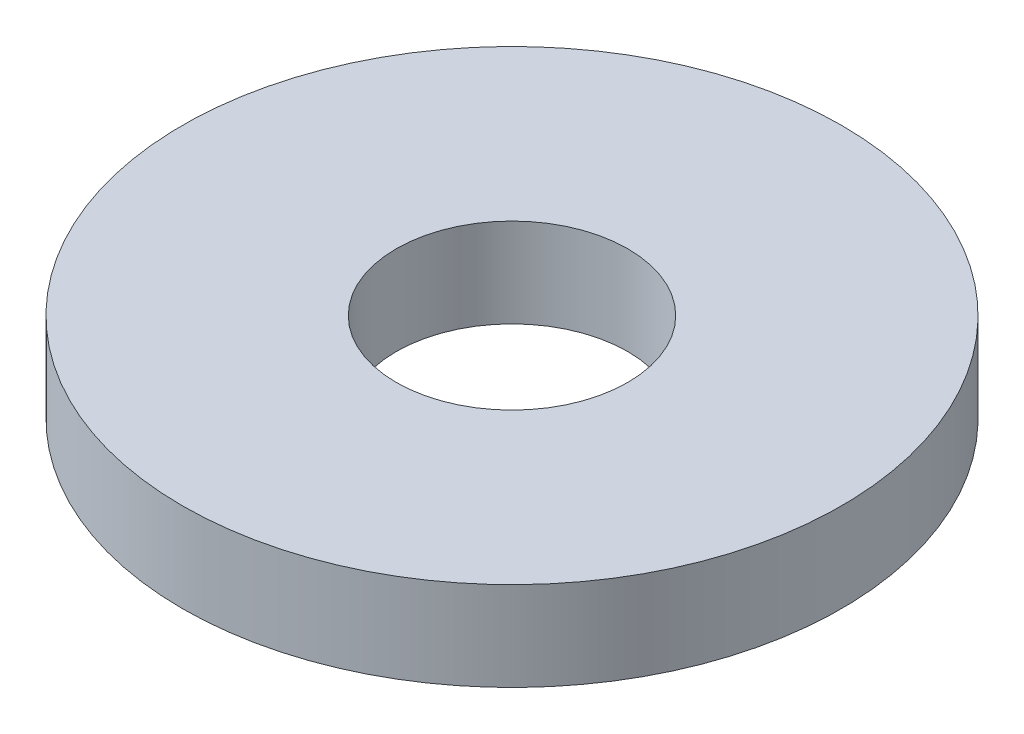
ISO-10303-21;
HEADER;
FILE_DESCRIPTION(('STEP AP214'),'2;1');
FILE_NAME('part.step','',(''),(''),'','','');
FILE_SCHEMA(('AUTOMOTIVE_DESIGN { 1 0 10303 214 1 1 1 1 }'));
ENDSEC;
DATA;
#1=APPLICATION_CONTEXT('core data for automotive mechanical design processes');
#2=APPLICATION_PROTOCOL_DEFINITION('international standard','automotive_design',2000,#1);
#3=PRODUCT_CONTEXT('',#1,'mechanical');
#4=PRODUCT('Part','Part','',(#3));
#5=PRODUCT_RELATED_PRODUCT_CATEGORY('part','',(#4));
#6=PRODUCT_DEFINITION_FORMATION('','',#4);
#7=PRODUCT_DEFINITION_CONTEXT('part definition',#1,'design');
#8=PRODUCT_DEFINITION('design','',#6,#7);
#9=PRODUCT_DEFINITION_SHAPE('','',#8);
#10=(LENGTH_UNIT() NAMED_UNIT(*) SI_UNIT(.MILLI.,.METRE.));
#11=(NAMED_UNIT(*) PLANE_ANGLE_UNIT() SI_UNIT($,.RADIAN.));
#12=(NAMED_UNIT(*) SI_UNIT($,.STERADIAN.) SOLID_ANGLE_UNIT());
#13=UNCERTAINTY_MEASURE_WITH_UNIT(LENGTH_MEASURE(1.E-05),#10,'distance_accuracy_value','');
#14=(GEOMETRIC_REPRESENTATION_CONTEXT(3) GLOBAL_UNCERTAINTY_ASSIGNED_CONTEXT((#13)) GLOBAL_UNIT_ASSIGNED_CONTEXT((#10,
#11,#12)) REPRESENTATION_CONTEXT('',''));
#15=CARTESIAN_POINT('',(0.,0.,0.));
#16=DIRECTION('',(0.,0.,1.));
#17=DIRECTION('',(1.,0.,0.));
#18=AXIS2_PLACEMENT_3D('',#15,#16,#17);
#19=CARTESIAN_POINT('',(0.,25.,0.));
#20=DIRECTION('',(0.,-1.,0.));
#21=DIRECTION('',(0.,0.,-1.));
#22=AXIS2_PLACEMENT_3D('',#19,#20,#21);
#23=CYLINDRICAL_SURFACE('',#22,92.5);
#24=CARTESIAN_POINT('',(0.,25.,0.));
#25=DIRECTION('',(0.,1.,0.));
#26=DIRECTION('',(0.,0.,1.));
#27=AXIS2_PLACEMENT_3D('',#24,#25,#26);
#28=CIRCLE('',#27,92.5);
#29=CARTESIAN_POINT('',(0.,25.,92.5));
#30=VERTEX_POINT('',#29);
#31=EDGE_CURVE('E10',#30,#30,#28,.T.);
#32=ORIENTED_EDGE('',*,*,#31,.F.);
#33=EDGE_LOOP('',(#32));
#34=FACE_BOUND('',#33,.T.);
#35=CARTESIAN_POINT('',(0.,0.,0.));
#36=DIRECTION('',(0.,1.,0.));
#37=DIRECTION('',(0.,0.,1.));
#38=AXIS2_PLACEMENT_3D('',#35,#36,#37);
#39=CIRCLE('',#38,92.5);
#40=CARTESIAN_POINT('',(0.,0.,92.5));
#41=VERTEX_POINT('',#40);
#42=EDGE_CURVE('E37',#41,#41,#39,.T.);
#43=ORIENTED_EDGE('',*,*,#42,.T.);
#44=EDGE_LOOP('',(#43));
#45=FACE_BOUND('',#44,.T.);
#46=ADVANCED_FACE('F40',(#34,#45),#23,.T.);
#47=CARTESIAN_POINT('',(0.,25.,0.));
#48=DIRECTION('',(0.,1.,0.));
#49=DIRECTION('',(0.,0.,1.));
#50=AXIS2_PLACEMENT_3D('',#47,#48,#49);
#51=PLANE('',#50);
#52=CARTESIAN_POINT('',(0.,25.,0.));
#53=DIRECTION('',(0.,1.,0.));
#54=DIRECTION('',(0.,0.,1.));
#55=AXIS2_PLACEMENT_3D('',#52,#53,#54);
#56=CIRCLE('',#55,32.5);
#57=CARTESIAN_POINT('',(0.,25.,32.5));
#58=VERTEX_POINT('',#57);
#59=EDGE_CURVE('E50',#58,#58,#56,.T.);
#60=ORIENTED_EDGE('',*,*,#59,.F.);
#61=EDGE_LOOP('',(#60));
#62=FACE_BOUND('',#61,.T.);
#63=ORIENTED_EDGE('',*,*,#31,.T.);
#64=EDGE_LOOP('',(#63));
#65=FACE_BOUND('',#64,.T.);
#66=ADVANCED_FACE('F59',(#62,#65),#51,.T.);
#67=CARTESIAN_POINT('',(0.,0.,0.));
#68=DIRECTION('',(0.,1.,0.));
#69=DIRECTION('',(0.,0.,1.));
#70=AXIS2_PLACEMENT_3D('',#67,#68,#69);
#71=PLANE('',#70);
#72=CARTESIAN_POINT('',(0.,0.,0.));
#73=DIRECTION('',(0.,1.,0.));
#74=DIRECTION('',(0.,0.,1.));
#75=AXIS2_PLACEMENT_3D('',#72,#73,#74);
#76=CIRCLE('',#75,32.5);
#77=CARTESIAN_POINT('',(0.,0.,32.5));
#78=VERTEX_POINT('',#77);
#79=EDGE_CURVE('E47',#78,#78,#76,.T.);
#80=ORIENTED_EDGE('',*,*,#79,.T.);
#81=EDGE_LOOP('',(#80));
#82=FACE_BOUND('',#81,.T.);
#83=ORIENTED_EDGE('',*,*,#42,.F.);
#84=EDGE_LOOP('',(#83));
#85=FACE_BOUND('',#84,.T.);
#86=ADVANCED_FACE('F58',(#82,#85),#71,.F.);
#87=CARTESIAN_POINT('',(0.,25.,0.));
#88=DIRECTION('',(0.,-1.,0.));
#89=DIRECTION('',(0.,0.,-1.));
#90=AXIS2_PLACEMENT_3D('',#87,#88,#89);
#91=CYLINDRICAL_SURFACE('',#90,32.5);
#92=ORIENTED_EDGE('',*,*,#59,.T.);
#93=EDGE_LOOP('',(#92));
#94=FACE_BOUND('',#93,.T.);
#95=ORIENTED_EDGE('',*,*,#79,.F.);
#96=EDGE_LOOP('',(#95));
#97=FACE_BOUND('',#96,.T.);
#98=ADVANCED_FACE('F54',(#94,#97),#91,.F.);
#99=CLOSED_SHELL('',(#46,#66,#86,#98));
#100=MANIFOLD_SOLID_BREP('B2',#99);
#101=ADVANCED_BREP_SHAPE_REPRESENTATION('',(#18,#100),#14);
#102=SHAPE_DEFINITION_REPRESENTATION(#9,#101);
ENDSEC;
END-ISO-10303-21;
